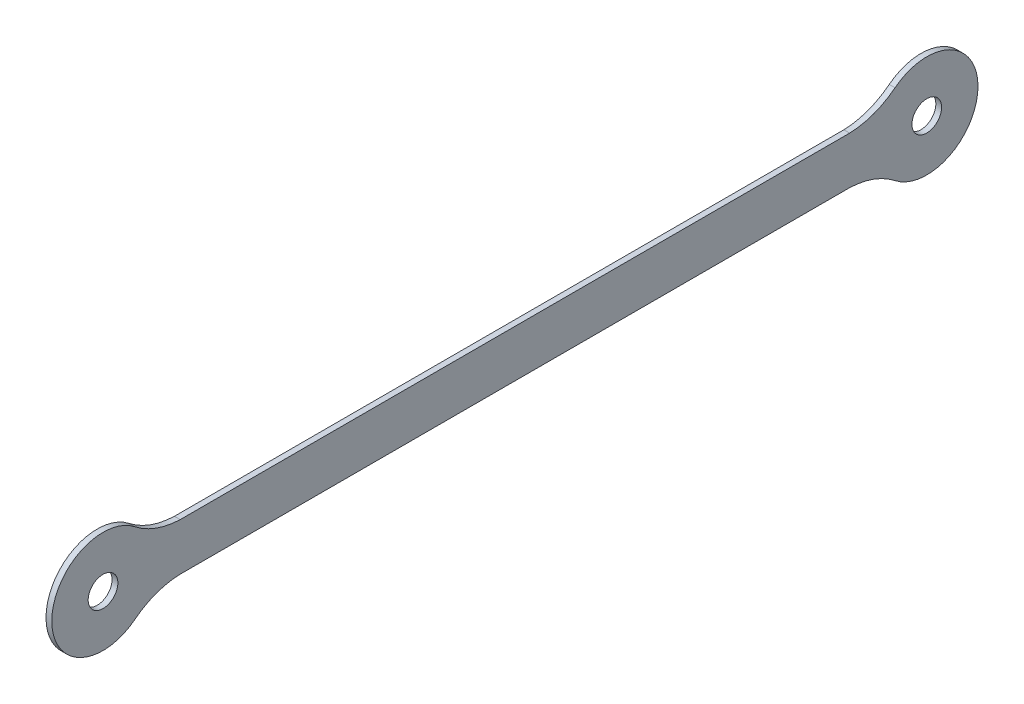
ISO-10303-21;
HEADER;
FILE_DESCRIPTION(('STEP AP214'),'2;1');
FILE_NAME('part.step','',(''),(''),'','','');
FILE_SCHEMA(('AUTOMOTIVE_DESIGN { 1 0 10303 214 1 1 1 1 }'));
ENDSEC;
DATA;
#1=APPLICATION_CONTEXT('core data for automotive mechanical design processes');
#2=APPLICATION_PROTOCOL_DEFINITION('international standard','automotive_design',2000,#1);
#3=PRODUCT_CONTEXT('',#1,'mechanical');
#4=PRODUCT('Part','Part','',(#3));
#5=PRODUCT_RELATED_PRODUCT_CATEGORY('part','',(#4));
#6=PRODUCT_DEFINITION_FORMATION('','',#4);
#7=PRODUCT_DEFINITION_CONTEXT('part definition',#1,'design');
#8=PRODUCT_DEFINITION('design','',#6,#7);
#9=PRODUCT_DEFINITION_SHAPE('','',#8);
#10=(LENGTH_UNIT() NAMED_UNIT(*) SI_UNIT(.MILLI.,.METRE.));
#11=(NAMED_UNIT(*) PLANE_ANGLE_UNIT() SI_UNIT($,.RADIAN.));
#12=(NAMED_UNIT(*) SI_UNIT($,.STERADIAN.) SOLID_ANGLE_UNIT());
#13=UNCERTAINTY_MEASURE_WITH_UNIT(LENGTH_MEASURE(1.E-05),#10,'distance_accuracy_value','');
#14=(GEOMETRIC_REPRESENTATION_CONTEXT(3) GLOBAL_UNCERTAINTY_ASSIGNED_CONTEXT((#13)) GLOBAL_UNIT_ASSIGNED_CONTEXT((#10,
#11,#12)) REPRESENTATION_CONTEXT('',''));
#15=CARTESIAN_POINT('',(0.,0.,0.));
#16=DIRECTION('',(0.,0.,1.));
#17=DIRECTION('',(1.,0.,0.));
#18=AXIS2_PLACEMENT_3D('',#15,#16,#17);
#19=CARTESIAN_POINT('',(1.5,-26.1728107021728,-86.2339461426278));
#20=DIRECTION('',(1.,0.,0.));
#21=DIRECTION('',(0.,0.,-1.));
#22=AXIS2_PLACEMENT_3D('',#19,#20,#21);
#23=PLANE('',#22);
#24=CARTESIAN_POINT('',(1.5,0.,106.889999999991));
#25=DIRECTION('',(1.,0.,0.));
#26=DIRECTION('',(0.,0.,-1.));
#27=AXIS2_PLACEMENT_3D('',#24,#25,#26);
#28=CIRCLE('',#27,3.85);
#29=CARTESIAN_POINT('',(1.5,0.,103.039999999991));
#30=VERTEX_POINT('',#29);
#31=EDGE_CURVE('E133',#30,#30,#28,.T.);
#32=ORIENTED_EDGE('',*,*,#31,.F.);
#33=EDGE_LOOP('',(#32));
#34=FACE_BOUND('',#33,.T.);
#35=CARTESIAN_POINT('',(1.5,-26.1728107021728,-86.2339461426278));
#36=DIRECTION('',(-1.,0.,0.));
#37=DIRECTION('',(0.,0.,-1.));
#38=AXIS2_PLACEMENT_3D('',#35,#36,#37);
#39=CIRCLE('',#38,20.0465397108328);
#40=CARTESIAN_POINT('',(1.5,-6.13627794309911,-86.8672781034122));
#41=VERTEX_POINT('',#40);
#42=CARTESIAN_POINT('',(1.5,-10.4366707146654,-98.6531913963291));
#43=VERTEX_POINT('',#42);
#44=EDGE_CURVE('E144',#41,#43,#39,.T.);
#45=ORIENTED_EDGE('',*,*,#44,.T.);
#46=CARTESIAN_POINT('',(1.5,4.44089209850063E-13,-106.889999999991));
#47=DIRECTION('',(1.,0.,0.));
#48=DIRECTION('',(0.,0.,-1.));
#49=AXIS2_PLACEMENT_3D('',#46,#47,#48);
#50=CIRCLE('',#49,13.2954545458109);
#51=CARTESIAN_POINT('',(1.5,10.4366707146656,-98.6531913963281));
#52=VERTEX_POINT('',#51);
#53=EDGE_CURVE('E92',#43,#52,#50,.T.);
#54=ORIENTED_EDGE('',*,*,#53,.T.);
#55=CARTESIAN_POINT('',(1.5,26.1728107021728,-86.2339461426278));
#56=DIRECTION('',(-1.,0.,0.));
#57=DIRECTION('',(0.,0.,1.));
#58=AXIS2_PLACEMENT_3D('',#55,#56,#57);
#59=CIRCLE('',#58,20.0465397108325);
#60=CARTESIAN_POINT('',(1.5,6.13627794309911,-86.8672781034122));
#61=VERTEX_POINT('',#60);
#62=EDGE_CURVE('E159',#52,#61,#59,.T.);
#63=ORIENTED_EDGE('',*,*,#62,.T.);
#64=DIRECTION('',(0.,0.,1.));
#65=VECTOR('',#64,1.);
#66=CARTESIAN_POINT('',(1.5,6.13627794309911,-86.8672781034122));
#67=LINE('',#66,#65);
#68=CARTESIAN_POINT('',(1.5,6.13627794309908,86.8672781034118));
#69=VERTEX_POINT('',#68);
#70=EDGE_CURVE('E172',#61,#69,#67,.T.);
#71=ORIENTED_EDGE('',*,*,#70,.T.);
#72=CARTESIAN_POINT('',(1.5,26.1728107021727,86.2339461426274));
#73=DIRECTION('',(-1.,0.,0.));
#74=DIRECTION('',(0.,0.,-1.));
#75=AXIS2_PLACEMENT_3D('',#72,#73,#74);
#76=CIRCLE('',#75,20.0465397108325);
#77=CARTESIAN_POINT('',(1.5,10.4366707146655,98.6531913963278));
#78=VERTEX_POINT('',#77);
#79=EDGE_CURVE('E111',#69,#78,#76,.T.);
#80=ORIENTED_EDGE('',*,*,#79,.T.);
#81=CARTESIAN_POINT('',(1.5,0.,106.889999999991));
#82=DIRECTION('',(1.,0.,0.));
#83=DIRECTION('',(0.,0.,-1.));
#84=AXIS2_PLACEMENT_3D('',#81,#82,#83);
#85=CIRCLE('',#84,13.2954545458112);
#86=CARTESIAN_POINT('',(1.5,-10.4366707146655,98.6531913963278));
#87=VERTEX_POINT('',#86);
#88=EDGE_CURVE('E105',#78,#87,#85,.T.);
#89=ORIENTED_EDGE('',*,*,#88,.T.);
#90=CARTESIAN_POINT('',(1.5,-26.1728107021727,86.2339461426274));
#91=DIRECTION('',(-1.,0.,0.));
#92=DIRECTION('',(0.,0.,1.));
#93=AXIS2_PLACEMENT_3D('',#90,#91,#92);
#94=CIRCLE('',#93,20.0465397108325);
#95=CARTESIAN_POINT('',(1.5,-6.13627794309907,86.8672781034118));
#96=VERTEX_POINT('',#95);
#97=EDGE_CURVE('E109',#87,#96,#94,.T.);
#98=ORIENTED_EDGE('',*,*,#97,.T.);
#99=DIRECTION('',(0.,0.,-1.));
#100=VECTOR('',#99,1.);
#101=CARTESIAN_POINT('',(1.5,-6.13627794309911,-86.8672781034122));
#102=LINE('',#101,#100);
#103=EDGE_CURVE('E49',#96,#41,#102,.T.);
#104=ORIENTED_EDGE('',*,*,#103,.T.);
#105=EDGE_LOOP('',(#45,#54,#63,#71,#80,#89,#98,#104));
#106=FACE_BOUND('',#105,.T.);
#107=CARTESIAN_POINT('',(1.5,4.44089209850063E-13,-106.889999999991));
#108=DIRECTION('',(1.,0.,0.));
#109=DIRECTION('',(0.,0.,-1.));
#110=AXIS2_PLACEMENT_3D('',#107,#108,#109);
#111=CIRCLE('',#110,3.85);
#112=CARTESIAN_POINT('',(1.5,4.44089209850063E-13,-110.739999999991));
#113=VERTEX_POINT('',#112);
#114=EDGE_CURVE('E181',#113,#113,#111,.T.);
#115=ORIENTED_EDGE('',*,*,#114,.F.);
#116=EDGE_LOOP('',(#115));
#117=FACE_BOUND('',#116,.T.);
#118=ADVANCED_FACE('F32',(#34,#106,#117),#23,.T.);
#119=CARTESIAN_POINT('',(0.,-26.1728107021728,-86.2339461426278));
#120=DIRECTION('',(1.,0.,0.));
#121=DIRECTION('',(0.,0.,-1.));
#122=AXIS2_PLACEMENT_3D('',#119,#120,#121);
#123=PLANE('',#122);
#124=CARTESIAN_POINT('',(0.,-26.1728107021728,-86.2339461426278));
#125=DIRECTION('',(-1.,0.,0.));
#126=DIRECTION('',(0.,0.,-1.));
#127=AXIS2_PLACEMENT_3D('',#124,#125,#126);
#128=CIRCLE('',#127,20.0465397108328);
#129=CARTESIAN_POINT('',(0.,-6.13627794309911,-86.8672781034122));
#130=VERTEX_POINT('',#129);
#131=CARTESIAN_POINT('',(0.,-10.4366707146654,-98.6531913963291));
#132=VERTEX_POINT('',#131);
#133=EDGE_CURVE('E129',#130,#132,#128,.T.);
#134=ORIENTED_EDGE('',*,*,#133,.F.);
#135=DIRECTION('',(0.,0.,-1.));
#136=VECTOR('',#135,1.);
#137=CARTESIAN_POINT('',(0.,-6.13627794309911,-86.8672781034122));
#138=LINE('',#137,#136);
#139=CARTESIAN_POINT('',(0.,-6.13627794309907,86.8672781034118));
#140=VERTEX_POINT('',#139);
#141=EDGE_CURVE('E84',#140,#130,#138,.T.);
#142=ORIENTED_EDGE('',*,*,#141,.F.);
#143=CARTESIAN_POINT('',(0.,-26.1728107021727,86.2339461426274));
#144=DIRECTION('',(-1.,0.,0.));
#145=DIRECTION('',(0.,0.,1.));
#146=AXIS2_PLACEMENT_3D('',#143,#144,#145);
#147=CIRCLE('',#146,20.0465397108325);
#148=CARTESIAN_POINT('',(0.,-10.4366707146655,98.6531913963278));
#149=VERTEX_POINT('',#148);
#150=EDGE_CURVE('E78',#149,#140,#147,.T.);
#151=ORIENTED_EDGE('',*,*,#150,.F.);
#152=CARTESIAN_POINT('',(0.,0.,106.889999999991));
#153=DIRECTION('',(1.,0.,0.));
#154=DIRECTION('',(0.,0.,-1.));
#155=AXIS2_PLACEMENT_3D('',#152,#153,#154);
#156=CIRCLE('',#155,13.2954545458112);
#157=CARTESIAN_POINT('',(0.,10.4366707146655,98.6531913963278));
#158=VERTEX_POINT('',#157);
#159=EDGE_CURVE('E119',#158,#149,#156,.T.);
#160=ORIENTED_EDGE('',*,*,#159,.F.);
#161=CARTESIAN_POINT('',(0.,26.1728107021727,86.2339461426274));
#162=DIRECTION('',(-1.,0.,0.));
#163=DIRECTION('',(0.,0.,-1.));
#164=AXIS2_PLACEMENT_3D('',#161,#162,#163);
#165=CIRCLE('',#164,20.0465397108325);
#166=CARTESIAN_POINT('',(0.,6.13627794309908,86.8672781034118));
#167=VERTEX_POINT('',#166);
#168=EDGE_CURVE('E139',#167,#158,#165,.T.);
#169=ORIENTED_EDGE('',*,*,#168,.F.);
#170=DIRECTION('',(0.,0.,1.));
#171=VECTOR('',#170,1.);
#172=CARTESIAN_POINT('',(0.,6.13627794309911,-86.8672781034122));
#173=LINE('',#172,#171);
#174=CARTESIAN_POINT('',(0.,6.13627794309911,-86.8672781034122));
#175=VERTEX_POINT('',#174);
#176=EDGE_CURVE('E137',#175,#167,#173,.T.);
#177=ORIENTED_EDGE('',*,*,#176,.F.);
#178=CARTESIAN_POINT('',(0.,26.1728107021728,-86.2339461426278));
#179=DIRECTION('',(-1.,0.,0.));
#180=DIRECTION('',(0.,0.,1.));
#181=AXIS2_PLACEMENT_3D('',#178,#179,#180);
#182=CIRCLE('',#181,20.0465397108325);
#183=CARTESIAN_POINT('',(0.,10.4366707146656,-98.6531913963281));
#184=VERTEX_POINT('',#183);
#185=EDGE_CURVE('E135',#184,#175,#182,.T.);
#186=ORIENTED_EDGE('',*,*,#185,.F.);
#187=CARTESIAN_POINT('',(0.,4.44089209850063E-13,-106.889999999991));
#188=DIRECTION('',(1.,0.,0.));
#189=DIRECTION('',(0.,0.,-1.));
#190=AXIS2_PLACEMENT_3D('',#187,#188,#189);
#191=CIRCLE('',#190,13.2954545458109);
#192=EDGE_CURVE('E132',#132,#184,#191,.T.);
#193=ORIENTED_EDGE('',*,*,#192,.F.);
#194=EDGE_LOOP('',(#134,#142,#151,#160,#169,#177,#186,#193));
#195=FACE_BOUND('',#194,.T.);
#196=CARTESIAN_POINT('',(0.,0.,106.889999999991));
#197=DIRECTION('',(1.,0.,0.));
#198=DIRECTION('',(0.,0.,-1.));
#199=AXIS2_PLACEMENT_3D('',#196,#197,#198);
#200=CIRCLE('',#199,3.85);
#201=CARTESIAN_POINT('',(0.,0.,103.039999999991));
#202=VERTEX_POINT('',#201);
#203=EDGE_CURVE('E178',#202,#202,#200,.T.);
#204=ORIENTED_EDGE('',*,*,#203,.T.);
#205=EDGE_LOOP('',(#204));
#206=FACE_BOUND('',#205,.T.);
#207=CARTESIAN_POINT('',(0.,4.44089209850063E-13,-106.889999999991));
#208=DIRECTION('',(1.,0.,0.));
#209=DIRECTION('',(0.,0.,-1.));
#210=AXIS2_PLACEMENT_3D('',#207,#208,#209);
#211=CIRCLE('',#210,3.85);
#212=CARTESIAN_POINT('',(0.,4.44089209850063E-13,-110.739999999991));
#213=VERTEX_POINT('',#212);
#214=EDGE_CURVE('E184',#213,#213,#211,.T.);
#215=ORIENTED_EDGE('',*,*,#214,.T.);
#216=EDGE_LOOP('',(#215));
#217=FACE_BOUND('',#216,.T.);
#218=ADVANCED_FACE('F163',(#195,#206,#217),#123,.F.);
#219=CARTESIAN_POINT('',(1.5,-26.1728107021728,-86.2339461426278));
#220=DIRECTION('',(-1.,0.,0.));
#221=DIRECTION('',(0.,0.,1.));
#222=AXIS2_PLACEMENT_3D('',#219,#220,#221);
#223=CYLINDRICAL_SURFACE('',#222,20.0465397108328);
#224=ORIENTED_EDGE('',*,*,#133,.T.);
#225=DIRECTION('',(-1.,0.,0.));
#226=VECTOR('',#225,1.);
#227=CARTESIAN_POINT('',(1.5,-10.4366707146654,-98.6531913963291));
#228=LINE('',#227,#226);
#229=EDGE_CURVE('E11',#43,#132,#228,.T.);
#230=ORIENTED_EDGE('',*,*,#229,.F.);
#231=ORIENTED_EDGE('',*,*,#44,.F.);
#232=DIRECTION('',(-1.,0.,0.));
#233=VECTOR('',#232,1.);
#234=CARTESIAN_POINT('',(1.5,-6.13627794309911,-86.8672781034122));
#235=LINE('',#234,#233);
#236=EDGE_CURVE('E125',#41,#130,#235,.T.);
#237=ORIENTED_EDGE('',*,*,#236,.T.);
#238=EDGE_LOOP('',(#224,#230,#231,#237));
#239=FACE_BOUND('',#238,.T.);
#240=ADVANCED_FACE('F34',(#239),#223,.F.);
#241=CARTESIAN_POINT('',(1.5,4.44089209850063E-13,-106.889999999991));
#242=DIRECTION('',(-1.,0.,0.));
#243=DIRECTION('',(0.,0.,1.));
#244=AXIS2_PLACEMENT_3D('',#241,#242,#243);
#245=CYLINDRICAL_SURFACE('',#244,13.2954545458109);
#246=ORIENTED_EDGE('',*,*,#192,.T.);
#247=DIRECTION('',(-1.,0.,0.));
#248=VECTOR('',#247,1.);
#249=CARTESIAN_POINT('',(1.5,10.4366707146656,-98.6531913963281));
#250=LINE('',#249,#248);
#251=EDGE_CURVE('E41',#52,#184,#250,.T.);
#252=ORIENTED_EDGE('',*,*,#251,.F.);
#253=ORIENTED_EDGE('',*,*,#53,.F.);
#254=ORIENTED_EDGE('',*,*,#229,.T.);
#255=EDGE_LOOP('',(#246,#252,#253,#254));
#256=FACE_BOUND('',#255,.T.);
#257=ADVANCED_FACE('F216',(#256),#245,.T.);
#258=CARTESIAN_POINT('',(1.5,26.1728107021728,-86.2339461426278));
#259=DIRECTION('',(-1.,0.,0.));
#260=DIRECTION('',(0.,0.,1.));
#261=AXIS2_PLACEMENT_3D('',#258,#259,#260);
#262=CYLINDRICAL_SURFACE('',#261,20.0465397108325);
#263=ORIENTED_EDGE('',*,*,#185,.T.);
#264=DIRECTION('',(-1.,0.,0.));
#265=VECTOR('',#264,1.);
#266=CARTESIAN_POINT('',(1.5,6.13627794309911,-86.8672781034122));
#267=LINE('',#266,#265);
#268=EDGE_CURVE('E151',#61,#175,#267,.T.);
#269=ORIENTED_EDGE('',*,*,#268,.F.);
#270=ORIENTED_EDGE('',*,*,#62,.F.);
#271=ORIENTED_EDGE('',*,*,#251,.T.);
#272=EDGE_LOOP('',(#263,#269,#270,#271));
#273=FACE_BOUND('',#272,.T.);
#274=ADVANCED_FACE('F157',(#273),#262,.F.);
#275=CARTESIAN_POINT('',(1.5,6.13627794309911,-86.8672781034122));
#276=DIRECTION('',(0.,-1.,0.));
#277=DIRECTION('',(0.,0.,-1.));
#278=AXIS2_PLACEMENT_3D('',#275,#276,#277);
#279=PLANE('',#278);
#280=ORIENTED_EDGE('',*,*,#176,.T.);
#281=DIRECTION('',(-1.,0.,0.));
#282=VECTOR('',#281,1.);
#283=CARTESIAN_POINT('',(1.5,6.13627794309908,86.8672781034118));
#284=LINE('',#283,#282);
#285=EDGE_CURVE('E148',#69,#167,#284,.T.);
#286=ORIENTED_EDGE('',*,*,#285,.F.);
#287=ORIENTED_EDGE('',*,*,#70,.F.);
#288=ORIENTED_EDGE('',*,*,#268,.T.);
#289=EDGE_LOOP('',(#280,#286,#287,#288));
#290=FACE_BOUND('',#289,.T.);
#291=ADVANCED_FACE('F168',(#290),#279,.F.);
#292=CARTESIAN_POINT('',(1.5,26.1728107021727,86.2339461426274));
#293=DIRECTION('',(-1.,0.,0.));
#294=DIRECTION('',(0.,0.,1.));
#295=AXIS2_PLACEMENT_3D('',#292,#293,#294);
#296=CYLINDRICAL_SURFACE('',#295,20.0465397108325);
#297=ORIENTED_EDGE('',*,*,#168,.T.);
#298=DIRECTION('',(-1.,0.,0.));
#299=VECTOR('',#298,1.);
#300=CARTESIAN_POINT('',(1.5,10.4366707146655,98.6531913963278));
#301=LINE('',#300,#299);
#302=EDGE_CURVE('E120',#78,#158,#301,.T.);
#303=ORIENTED_EDGE('',*,*,#302,.F.);
#304=ORIENTED_EDGE('',*,*,#79,.F.);
#305=ORIENTED_EDGE('',*,*,#285,.T.);
#306=EDGE_LOOP('',(#297,#303,#304,#305));
#307=FACE_BOUND('',#306,.T.);
#308=ADVANCED_FACE('F171',(#307),#296,.F.);
#309=CARTESIAN_POINT('',(1.5,0.,106.889999999991));
#310=DIRECTION('',(-1.,0.,0.));
#311=DIRECTION('',(0.,0.,1.));
#312=AXIS2_PLACEMENT_3D('',#309,#310,#311);
#313=CYLINDRICAL_SURFACE('',#312,13.2954545458112);
#314=ORIENTED_EDGE('',*,*,#159,.T.);
#315=DIRECTION('',(-1.,0.,0.));
#316=VECTOR('',#315,1.);
#317=CARTESIAN_POINT('',(1.5,-10.4366707146655,98.6531913963278));
#318=LINE('',#317,#316);
#319=EDGE_CURVE('E116',#87,#149,#318,.T.);
#320=ORIENTED_EDGE('',*,*,#319,.F.);
#321=ORIENTED_EDGE('',*,*,#88,.F.);
#322=ORIENTED_EDGE('',*,*,#302,.T.);
#323=EDGE_LOOP('',(#314,#320,#321,#322));
#324=FACE_BOUND('',#323,.T.);
#325=ADVANCED_FACE('F117',(#324),#313,.T.);
#326=CARTESIAN_POINT('',(1.5,-26.1728107021727,86.2339461426274));
#327=DIRECTION('',(-1.,0.,0.));
#328=DIRECTION('',(0.,0.,1.));
#329=AXIS2_PLACEMENT_3D('',#326,#327,#328);
#330=CYLINDRICAL_SURFACE('',#329,20.0465397108325);
#331=ORIENTED_EDGE('',*,*,#150,.T.);
#332=DIRECTION('',(-1.,0.,0.));
#333=VECTOR('',#332,1.);
#334=CARTESIAN_POINT('',(1.5,-6.13627794309907,86.8672781034118));
#335=LINE('',#334,#333);
#336=EDGE_CURVE('E121',#96,#140,#335,.T.);
#337=ORIENTED_EDGE('',*,*,#336,.F.);
#338=ORIENTED_EDGE('',*,*,#97,.F.);
#339=ORIENTED_EDGE('',*,*,#319,.T.);
#340=EDGE_LOOP('',(#331,#337,#338,#339));
#341=FACE_BOUND('',#340,.T.);
#342=ADVANCED_FACE('F123',(#341),#330,.F.);
#343=CARTESIAN_POINT('',(1.5,-6.13627794309911,-86.8672781034122));
#344=DIRECTION('',(0.,1.,0.));
#345=DIRECTION('',(0.,0.,1.));
#346=AXIS2_PLACEMENT_3D('',#343,#344,#345);
#347=PLANE('',#346);
#348=ORIENTED_EDGE('',*,*,#141,.T.);
#349=ORIENTED_EDGE('',*,*,#236,.F.);
#350=ORIENTED_EDGE('',*,*,#103,.F.);
#351=ORIENTED_EDGE('',*,*,#336,.T.);
#352=EDGE_LOOP('',(#348,#349,#350,#351));
#353=FACE_BOUND('',#352,.T.);
#354=ADVANCED_FACE('F204',(#353),#347,.F.);
#355=CARTESIAN_POINT('',(1.5,0.,106.889999999991));
#356=DIRECTION('',(-1.,0.,0.));
#357=DIRECTION('',(0.,0.,1.));
#358=AXIS2_PLACEMENT_3D('',#355,#356,#357);
#359=CYLINDRICAL_SURFACE('',#358,3.85);
#360=ORIENTED_EDGE('',*,*,#31,.T.);
#361=EDGE_LOOP('',(#360));
#362=FACE_BOUND('',#361,.T.);
#363=ORIENTED_EDGE('',*,*,#203,.F.);
#364=EDGE_LOOP('',(#363));
#365=FACE_BOUND('',#364,.T.);
#366=ADVANCED_FACE('F201',(#362,#365),#359,.F.);
#367=CARTESIAN_POINT('',(1.5,4.44089209850063E-13,-106.889999999991));
#368=DIRECTION('',(-1.,0.,0.));
#369=DIRECTION('',(0.,0.,1.));
#370=AXIS2_PLACEMENT_3D('',#367,#368,#369);
#371=CYLINDRICAL_SURFACE('',#370,3.85);
#372=ORIENTED_EDGE('',*,*,#114,.T.);
#373=EDGE_LOOP('',(#372));
#374=FACE_BOUND('',#373,.T.);
#375=ORIENTED_EDGE('',*,*,#214,.F.);
#376=EDGE_LOOP('',(#375));
#377=FACE_BOUND('',#376,.T.);
#378=ADVANCED_FACE('F190',(#374,#377),#371,.F.);
#379=CLOSED_SHELL('',(#118,#218,#240,#257,#274,#291,#308,#325,#342,#354,#366,#378));
#380=MANIFOLD_SOLID_BREP('B2',#379);
#381=ADVANCED_BREP_SHAPE_REPRESENTATION('',(#18,#380),#14);
#382=SHAPE_DEFINITION_REPRESENTATION(#9,#381);
ENDSEC;
END-ISO-10303-21;
